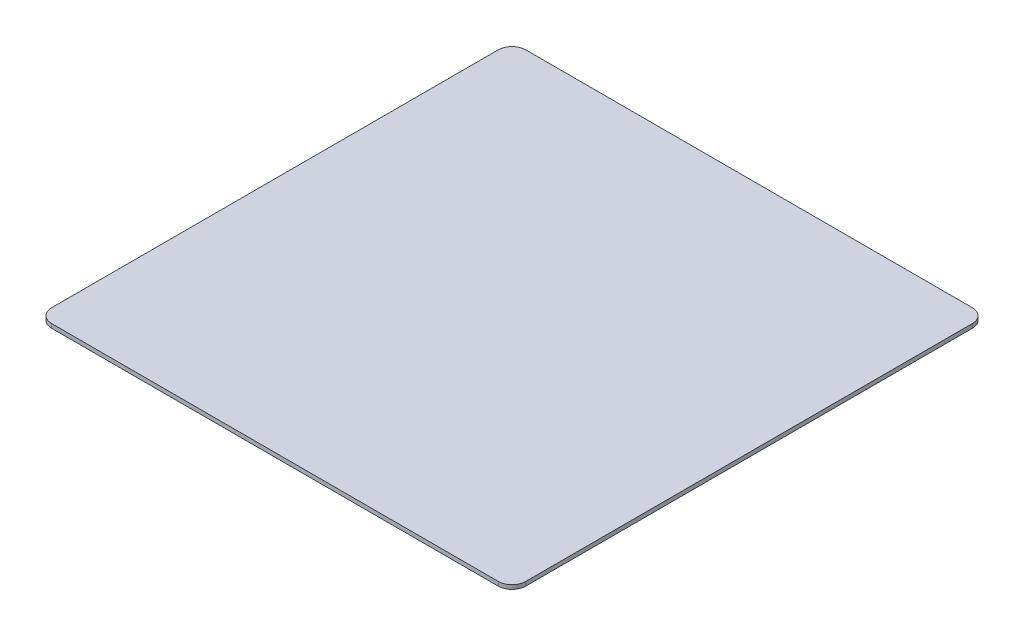
ISO-10303-21;
HEADER;
FILE_DESCRIPTION(('STEP AP214'),'2;1');
FILE_NAME('part.step','',(''),(''),'','','');
FILE_SCHEMA(('AUTOMOTIVE_DESIGN { 1 0 10303 214 1 1 1 1 }'));
ENDSEC;
DATA;
#1=APPLICATION_CONTEXT('core data for automotive mechanical design processes');
#2=APPLICATION_PROTOCOL_DEFINITION('international standard','automotive_design',2000,#1);
#3=PRODUCT_CONTEXT('',#1,'mechanical');
#4=PRODUCT('Part','Part','',(#3));
#5=PRODUCT_RELATED_PRODUCT_CATEGORY('part','',(#4));
#6=PRODUCT_DEFINITION_FORMATION('','',#4);
#7=PRODUCT_DEFINITION_CONTEXT('part definition',#1,'design');
#8=PRODUCT_DEFINITION('design','',#6,#7);
#9=PRODUCT_DEFINITION_SHAPE('','',#8);
#10=(LENGTH_UNIT() NAMED_UNIT(*) SI_UNIT(.MILLI.,.METRE.));
#11=(NAMED_UNIT(*) PLANE_ANGLE_UNIT() SI_UNIT($,.RADIAN.));
#12=(NAMED_UNIT(*) SI_UNIT($,.STERADIAN.) SOLID_ANGLE_UNIT());
#13=UNCERTAINTY_MEASURE_WITH_UNIT(LENGTH_MEASURE(1.E-05),#10,'distance_accuracy_value','');
#14=(GEOMETRIC_REPRESENTATION_CONTEXT(3) GLOBAL_UNCERTAINTY_ASSIGNED_CONTEXT((#13)) GLOBAL_UNIT_ASSIGNED_CONTEXT((#10,
#11,#12)) REPRESENTATION_CONTEXT('',''));
#15=CARTESIAN_POINT('',(0.,0.,0.));
#16=DIRECTION('',(0.,0.,1.));
#17=DIRECTION('',(1.,0.,0.));
#18=AXIS2_PLACEMENT_3D('',#15,#16,#17);
#19=CARTESIAN_POINT('',(-32.5,0.6,32.5));
#20=DIRECTION('',(0.,-1.,0.));
#21=DIRECTION('',(0.,0.,-1.));
#22=AXIS2_PLACEMENT_3D('',#19,#20,#21);
#23=CYLINDRICAL_SURFACE('',#22,2.);
#24=CARTESIAN_POINT('',(-32.5,0.,32.5));
#25=DIRECTION('',(0.,1.,0.));
#26=DIRECTION('',(0.,0.,-1.));
#27=AXIS2_PLACEMENT_3D('',#24,#25,#26);
#28=CIRCLE('',#27,2.);
#29=CARTESIAN_POINT('',(-34.5,0.,32.5));
#30=VERTEX_POINT('',#29);
#31=CARTESIAN_POINT('',(-32.5,0.,34.5));
#32=VERTEX_POINT('',#31);
#33=EDGE_CURVE('E135',#30,#32,#28,.T.);
#34=ORIENTED_EDGE('',*,*,#33,.T.);
#35=DIRECTION('',(0.,-1.,0.));
#36=VECTOR('',#35,1.);
#37=CARTESIAN_POINT('',(-32.5,0.6,34.5));
#38=LINE('',#37,#36);
#39=CARTESIAN_POINT('',(-32.5,0.6,34.5));
#40=VERTEX_POINT('',#39);
#41=EDGE_CURVE('E11',#40,#32,#38,.T.);
#42=ORIENTED_EDGE('',*,*,#41,.F.);
#43=CARTESIAN_POINT('',(-32.5,0.6,32.5));
#44=DIRECTION('',(0.,1.,0.));
#45=DIRECTION('',(0.,0.,-1.));
#46=AXIS2_PLACEMENT_3D('',#43,#44,#45);
#47=CIRCLE('',#46,2.);
#48=CARTESIAN_POINT('',(-34.5,0.6,32.5));
#49=VERTEX_POINT('',#48);
#50=EDGE_CURVE('E149',#49,#40,#47,.T.);
#51=ORIENTED_EDGE('',*,*,#50,.F.);
#52=DIRECTION('',(0.,-1.,0.));
#53=VECTOR('',#52,1.);
#54=CARTESIAN_POINT('',(-34.5,0.6,32.5));
#55=LINE('',#54,#53);
#56=EDGE_CURVE('E131',#49,#30,#55,.T.);
#57=ORIENTED_EDGE('',*,*,#56,.T.);
#58=EDGE_LOOP('',(#34,#42,#51,#57));
#59=FACE_BOUND('',#58,.T.);
#60=ADVANCED_FACE('F39',(#59),#23,.T.);
#61=CARTESIAN_POINT('',(-32.5,0.6,34.5));
#62=DIRECTION('',(0.,0.,-1.));
#63=DIRECTION('',(-1.,0.,0.));
#64=AXIS2_PLACEMENT_3D('',#61,#62,#63);
#65=PLANE('',#64);
#66=DIRECTION('',(1.,0.,0.));
#67=VECTOR('',#66,1.);
#68=CARTESIAN_POINT('',(-32.5,0.,34.5));
#69=LINE('',#68,#67);
#70=CARTESIAN_POINT('',(32.5,0.,34.5));
#71=VERTEX_POINT('',#70);
#72=EDGE_CURVE('E138',#32,#71,#69,.T.);
#73=ORIENTED_EDGE('',*,*,#72,.T.);
#74=DIRECTION('',(0.,-1.,0.));
#75=VECTOR('',#74,1.);
#76=CARTESIAN_POINT('',(32.5,0.6,34.5));
#77=LINE('',#76,#75);
#78=CARTESIAN_POINT('',(32.5,0.6,34.5));
#79=VERTEX_POINT('',#78);
#80=EDGE_CURVE('E47',#79,#71,#77,.T.);
#81=ORIENTED_EDGE('',*,*,#80,.F.);
#82=DIRECTION('',(1.,0.,0.));
#83=VECTOR('',#82,1.);
#84=CARTESIAN_POINT('',(-32.5,0.6,34.5));
#85=LINE('',#84,#83);
#86=EDGE_CURVE('E98',#40,#79,#85,.T.);
#87=ORIENTED_EDGE('',*,*,#86,.F.);
#88=ORIENTED_EDGE('',*,*,#41,.T.);
#89=EDGE_LOOP('',(#73,#81,#87,#88));
#90=FACE_BOUND('',#89,.T.);
#91=ADVANCED_FACE('F184',(#90),#65,.F.);
#92=CARTESIAN_POINT('',(32.5,0.6,32.5));
#93=DIRECTION('',(0.,-1.,0.));
#94=DIRECTION('',(0.,0.,-1.));
#95=AXIS2_PLACEMENT_3D('',#92,#93,#94);
#96=CYLINDRICAL_SURFACE('',#95,2.);
#97=CARTESIAN_POINT('',(32.5,0.,32.5));
#98=DIRECTION('',(0.,1.,0.));
#99=DIRECTION('',(0.,0.,1.));
#100=AXIS2_PLACEMENT_3D('',#97,#98,#99);
#101=CIRCLE('',#100,2.);
#102=CARTESIAN_POINT('',(34.5,0.,32.5));
#103=VERTEX_POINT('',#102);
#104=EDGE_CURVE('E140',#71,#103,#101,.T.);
#105=ORIENTED_EDGE('',*,*,#104,.T.);
#106=DIRECTION('',(0.,-1.,0.));
#107=VECTOR('',#106,1.);
#108=CARTESIAN_POINT('',(34.5,0.6,32.5));
#109=LINE('',#108,#107);
#110=CARTESIAN_POINT('',(34.5,0.6,32.5));
#111=VERTEX_POINT('',#110);
#112=EDGE_CURVE('E156',#111,#103,#109,.T.);
#113=ORIENTED_EDGE('',*,*,#112,.F.);
#114=CARTESIAN_POINT('',(32.5,0.6,32.5));
#115=DIRECTION('',(0.,1.,0.));
#116=DIRECTION('',(0.,0.,1.));
#117=AXIS2_PLACEMENT_3D('',#114,#115,#116);
#118=CIRCLE('',#117,2.);
#119=EDGE_CURVE('E164',#79,#111,#118,.T.);
#120=ORIENTED_EDGE('',*,*,#119,.F.);
#121=ORIENTED_EDGE('',*,*,#80,.T.);
#122=EDGE_LOOP('',(#105,#113,#120,#121));
#123=FACE_BOUND('',#122,.T.);
#124=ADVANCED_FACE('F162',(#123),#96,.T.);
#125=CARTESIAN_POINT('',(34.5,0.6,32.5));
#126=DIRECTION('',(-1.,0.,0.));
#127=DIRECTION('',(0.,0.,1.));
#128=AXIS2_PLACEMENT_3D('',#125,#126,#127);
#129=PLANE('',#128);
#130=DIRECTION('',(0.,0.,-1.));
#131=VECTOR('',#130,1.);
#132=CARTESIAN_POINT('',(34.5,0.,32.5));
#133=LINE('',#132,#131);
#134=CARTESIAN_POINT('',(34.5,0.,-32.5));
#135=VERTEX_POINT('',#134);
#136=EDGE_CURVE('E142',#103,#135,#133,.T.);
#137=ORIENTED_EDGE('',*,*,#136,.T.);
#138=DIRECTION('',(0.,-1.,0.));
#139=VECTOR('',#138,1.);
#140=CARTESIAN_POINT('',(34.5,0.6,-32.5));
#141=LINE('',#140,#139);
#142=CARTESIAN_POINT('',(34.5,0.6,-32.5));
#143=VERTEX_POINT('',#142);
#144=EDGE_CURVE('E153',#143,#135,#141,.T.);
#145=ORIENTED_EDGE('',*,*,#144,.F.);
#146=DIRECTION('',(0.,0.,-1.));
#147=VECTOR('',#146,1.);
#148=CARTESIAN_POINT('',(34.5,0.6,32.5));
#149=LINE('',#148,#147);
#150=EDGE_CURVE('E176',#111,#143,#149,.T.);
#151=ORIENTED_EDGE('',*,*,#150,.F.);
#152=ORIENTED_EDGE('',*,*,#112,.T.);
#153=EDGE_LOOP('',(#137,#145,#151,#152));
#154=FACE_BOUND('',#153,.T.);
#155=ADVANCED_FACE('F172',(#154),#129,.F.);
#156=CARTESIAN_POINT('',(32.5,0.6,-32.5));
#157=DIRECTION('',(0.,-1.,0.));
#158=DIRECTION('',(0.,0.,-1.));
#159=AXIS2_PLACEMENT_3D('',#156,#157,#158);
#160=CYLINDRICAL_SURFACE('',#159,2.);
#161=CARTESIAN_POINT('',(32.5,0.,-32.5));
#162=DIRECTION('',(0.,1.,0.));
#163=DIRECTION('',(0.,0.,-1.));
#164=AXIS2_PLACEMENT_3D('',#161,#162,#163);
#165=CIRCLE('',#164,2.);
#166=CARTESIAN_POINT('',(32.5,0.,-34.5));
#167=VERTEX_POINT('',#166);
#168=EDGE_CURVE('E144',#135,#167,#165,.T.);
#169=ORIENTED_EDGE('',*,*,#168,.T.);
#170=DIRECTION('',(0.,-1.,0.));
#171=VECTOR('',#170,1.);
#172=CARTESIAN_POINT('',(32.5,0.6,-34.5));
#173=LINE('',#172,#171);
#174=CARTESIAN_POINT('',(32.5,0.6,-34.5));
#175=VERTEX_POINT('',#174);
#176=EDGE_CURVE('E126',#175,#167,#173,.T.);
#177=ORIENTED_EDGE('',*,*,#176,.F.);
#178=CARTESIAN_POINT('',(32.5,0.6,-32.5));
#179=DIRECTION('',(0.,1.,0.));
#180=DIRECTION('',(0.,0.,-1.));
#181=AXIS2_PLACEMENT_3D('',#178,#179,#180);
#182=CIRCLE('',#181,2.);
#183=EDGE_CURVE('E117',#143,#175,#182,.T.);
#184=ORIENTED_EDGE('',*,*,#183,.F.);
#185=ORIENTED_EDGE('',*,*,#144,.T.);
#186=EDGE_LOOP('',(#169,#177,#184,#185));
#187=FACE_BOUND('',#186,.T.);
#188=ADVANCED_FACE('F175',(#187),#160,.T.);
#189=CARTESIAN_POINT('',(-32.5,0.6,-34.5));
#190=DIRECTION('',(0.,0.,1.));
#191=DIRECTION('',(1.,0.,0.));
#192=AXIS2_PLACEMENT_3D('',#189,#190,#191);
#193=PLANE('',#192);
#194=DIRECTION('',(-1.,0.,0.));
#195=VECTOR('',#194,1.);
#196=CARTESIAN_POINT('',(-32.5,0.,-34.5));
#197=LINE('',#196,#195);
#198=CARTESIAN_POINT('',(-32.5,0.,-34.5));
#199=VERTEX_POINT('',#198);
#200=EDGE_CURVE('E125',#167,#199,#197,.T.);
#201=ORIENTED_EDGE('',*,*,#200,.T.);
#202=DIRECTION('',(0.,-1.,0.));
#203=VECTOR('',#202,1.);
#204=CARTESIAN_POINT('',(-32.5,0.6,-34.5));
#205=LINE('',#204,#203);
#206=CARTESIAN_POINT('',(-32.5,0.6,-34.5));
#207=VERTEX_POINT('',#206);
#208=EDGE_CURVE('E122',#207,#199,#205,.T.);
#209=ORIENTED_EDGE('',*,*,#208,.F.);
#210=DIRECTION('',(-1.,0.,0.));
#211=VECTOR('',#210,1.);
#212=CARTESIAN_POINT('',(-32.5,0.6,-34.5));
#213=LINE('',#212,#211);
#214=EDGE_CURVE('E111',#175,#207,#213,.T.);
#215=ORIENTED_EDGE('',*,*,#214,.F.);
#216=ORIENTED_EDGE('',*,*,#176,.T.);
#217=EDGE_LOOP('',(#201,#209,#215,#216));
#218=FACE_BOUND('',#217,.T.);
#219=ADVANCED_FACE('F123',(#218),#193,.F.);
#220=CARTESIAN_POINT('',(-32.5,0.6,-32.5));
#221=DIRECTION('',(0.,-1.,0.));
#222=DIRECTION('',(0.,0.,-1.));
#223=AXIS2_PLACEMENT_3D('',#220,#221,#222);
#224=CYLINDRICAL_SURFACE('',#223,2.);
#225=CARTESIAN_POINT('',(-32.5,0.,-32.5));
#226=DIRECTION('',(0.,1.,0.));
#227=DIRECTION('',(0.,0.,-1.));
#228=AXIS2_PLACEMENT_3D('',#225,#226,#227);
#229=CIRCLE('',#228,2.);
#230=CARTESIAN_POINT('',(-34.5,0.,-32.5));
#231=VERTEX_POINT('',#230);
#232=EDGE_CURVE('E84',#199,#231,#229,.T.);
#233=ORIENTED_EDGE('',*,*,#232,.T.);
#234=DIRECTION('',(0.,-1.,0.));
#235=VECTOR('',#234,1.);
#236=CARTESIAN_POINT('',(-34.5,0.6,-32.5));
#237=LINE('',#236,#235);
#238=CARTESIAN_POINT('',(-34.5,0.6,-32.5));
#239=VERTEX_POINT('',#238);
#240=EDGE_CURVE('E127',#239,#231,#237,.T.);
#241=ORIENTED_EDGE('',*,*,#240,.F.);
#242=CARTESIAN_POINT('',(-32.5,0.6,-32.5));
#243=DIRECTION('',(0.,1.,0.));
#244=DIRECTION('',(0.,0.,-1.));
#245=AXIS2_PLACEMENT_3D('',#242,#243,#244);
#246=CIRCLE('',#245,2.);
#247=EDGE_CURVE('E115',#207,#239,#246,.T.);
#248=ORIENTED_EDGE('',*,*,#247,.F.);
#249=ORIENTED_EDGE('',*,*,#208,.T.);
#250=EDGE_LOOP('',(#233,#241,#248,#249));
#251=FACE_BOUND('',#250,.T.);
#252=ADVANCED_FACE('F129',(#251),#224,.T.);
#253=CARTESIAN_POINT('',(-34.5,0.6,32.5));
#254=DIRECTION('',(1.,0.,0.));
#255=DIRECTION('',(0.,0.,-1.));
#256=AXIS2_PLACEMENT_3D('',#253,#254,#255);
#257=PLANE('',#256);
#258=DIRECTION('',(0.,0.,1.));
#259=VECTOR('',#258,1.);
#260=CARTESIAN_POINT('',(-34.5,0.,32.5));
#261=LINE('',#260,#259);
#262=EDGE_CURVE('E90',#231,#30,#261,.T.);
#263=ORIENTED_EDGE('',*,*,#262,.T.);
#264=ORIENTED_EDGE('',*,*,#56,.F.);
#265=DIRECTION('',(0.,0.,1.));
#266=VECTOR('',#265,1.);
#267=CARTESIAN_POINT('',(-34.5,0.6,32.5));
#268=LINE('',#267,#266);
#269=EDGE_CURVE('E55',#239,#49,#268,.T.);
#270=ORIENTED_EDGE('',*,*,#269,.F.);
#271=ORIENTED_EDGE('',*,*,#240,.T.);
#272=EDGE_LOOP('',(#263,#264,#270,#271));
#273=FACE_BOUND('',#272,.T.);
#274=ADVANCED_FACE('F200',(#273),#257,.F.);
#275=CARTESIAN_POINT('',(-32.5,0.6,32.5));
#276=DIRECTION('',(0.,-1.,0.));
#277=DIRECTION('',(0.,0.,-1.));
#278=AXIS2_PLACEMENT_3D('',#275,#276,#277);
#279=PLANE('',#278);
#280=ORIENTED_EDGE('',*,*,#50,.T.);
#281=ORIENTED_EDGE('',*,*,#86,.T.);
#282=ORIENTED_EDGE('',*,*,#119,.T.);
#283=ORIENTED_EDGE('',*,*,#150,.T.);
#284=ORIENTED_EDGE('',*,*,#183,.T.);
#285=ORIENTED_EDGE('',*,*,#214,.T.);
#286=ORIENTED_EDGE('',*,*,#247,.T.);
#287=ORIENTED_EDGE('',*,*,#269,.T.);
#288=EDGE_LOOP('',(#280,#281,#282,#283,#284,#285,#286,#287));
#289=FACE_BOUND('',#288,.T.);
#290=ADVANCED_FACE('F113',(#289),#279,.F.);
#291=CARTESIAN_POINT('',(-32.5,0.,32.5));
#292=DIRECTION('',(0.,-1.,0.));
#293=DIRECTION('',(0.,0.,-1.));
#294=AXIS2_PLACEMENT_3D('',#291,#292,#293);
#295=PLANE('',#294);
#296=ORIENTED_EDGE('',*,*,#33,.F.);
#297=ORIENTED_EDGE('',*,*,#262,.F.);
#298=ORIENTED_EDGE('',*,*,#232,.F.);
#299=ORIENTED_EDGE('',*,*,#200,.F.);
#300=ORIENTED_EDGE('',*,*,#168,.F.);
#301=ORIENTED_EDGE('',*,*,#136,.F.);
#302=ORIENTED_EDGE('',*,*,#104,.F.);
#303=ORIENTED_EDGE('',*,*,#72,.F.);
#304=EDGE_LOOP('',(#296,#297,#298,#299,#300,#301,#302,#303));
#305=FACE_BOUND('',#304,.T.);
#306=ADVANCED_FACE('F168',(#305),#295,.T.);
#307=CLOSED_SHELL('',(#60,#91,#124,#155,#188,#219,#252,#274,#290,#306));
#308=MANIFOLD_SOLID_BREP('B2',#307);
#309=ADVANCED_BREP_SHAPE_REPRESENTATION('',(#18,#308),#14);
#310=SHAPE_DEFINITION_REPRESENTATION(#9,#309);
ENDSEC;
END-ISO-10303-21;
